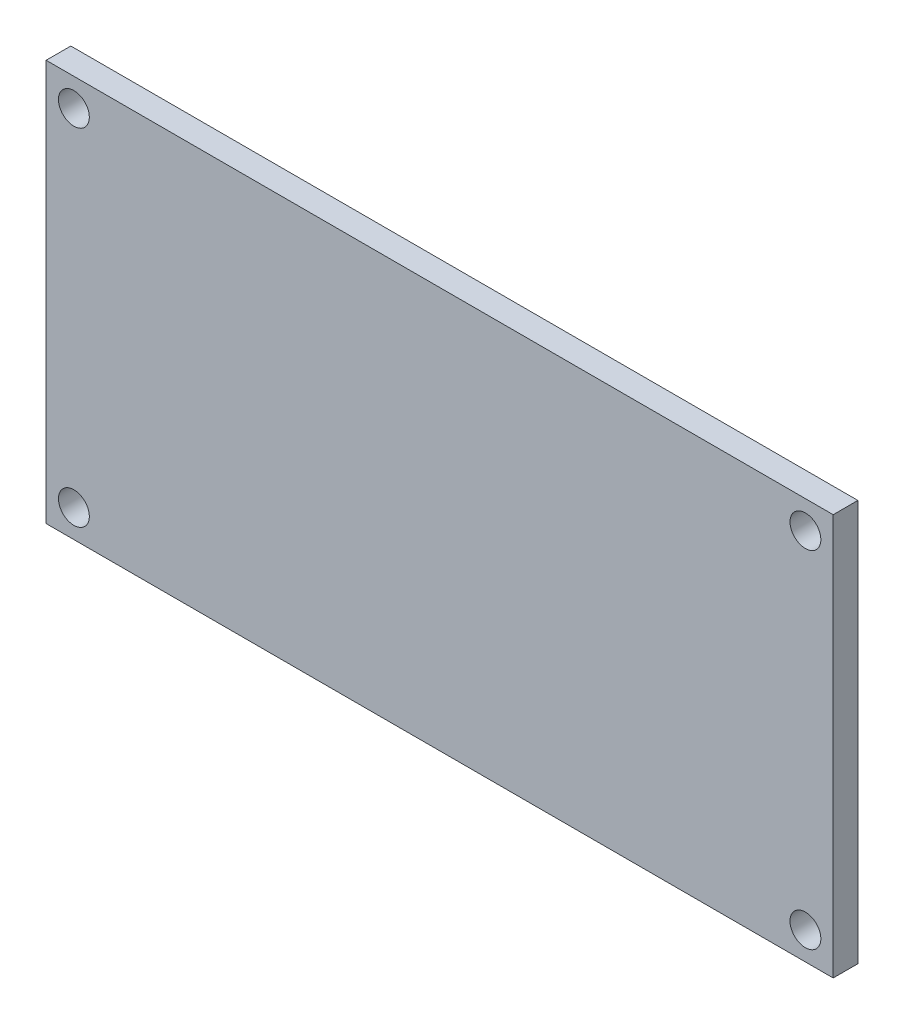
ISO-10303-21;
HEADER;
FILE_DESCRIPTION(('STEP AP214'),'2;1');
FILE_NAME('part.step','',(''),(''),'','','');
FILE_SCHEMA(('AUTOMOTIVE_DESIGN { 1 0 10303 214 1 1 1 1 }'));
ENDSEC;
DATA;
#1=APPLICATION_CONTEXT('core data for automotive mechanical design processes');
#2=APPLICATION_PROTOCOL_DEFINITION('international standard','automotive_design',2000,#1);
#3=PRODUCT_CONTEXT('',#1,'mechanical');
#4=PRODUCT('Part','Part','',(#3));
#5=PRODUCT_RELATED_PRODUCT_CATEGORY('part','',(#4));
#6=PRODUCT_DEFINITION_FORMATION('','',#4);
#7=PRODUCT_DEFINITION_CONTEXT('part definition',#1,'design');
#8=PRODUCT_DEFINITION('design','',#6,#7);
#9=PRODUCT_DEFINITION_SHAPE('','',#8);
#10=(LENGTH_UNIT() NAMED_UNIT(*) SI_UNIT(.MILLI.,.METRE.));
#11=(NAMED_UNIT(*) PLANE_ANGLE_UNIT() SI_UNIT($,.RADIAN.));
#12=(NAMED_UNIT(*) SI_UNIT($,.STERADIAN.) SOLID_ANGLE_UNIT());
#13=UNCERTAINTY_MEASURE_WITH_UNIT(LENGTH_MEASURE(1.E-05),#10,'distance_accuracy_value','');
#14=(GEOMETRIC_REPRESENTATION_CONTEXT(3) GLOBAL_UNCERTAINTY_ASSIGNED_CONTEXT((#13)) GLOBAL_UNIT_ASSIGNED_CONTEXT((#10,
#11,#12)) REPRESENTATION_CONTEXT('',''));
#15=CARTESIAN_POINT('',(0.,0.,0.));
#16=DIRECTION('',(0.,0.,1.));
#17=DIRECTION('',(1.,0.,0.));
#18=AXIS2_PLACEMENT_3D('',#15,#16,#17);
#19=CARTESIAN_POINT('',(0.,0.,1.6));
#20=DIRECTION('',(0.,0.,-1.));
#21=DIRECTION('',(-1.,0.,0.));
#22=AXIS2_PLACEMENT_3D('',#19,#20,#21);
#23=PLANE('',#22);
#24=DIRECTION('',(0.,1.,0.));
#25=VECTOR('',#24,1.);
#26=CARTESIAN_POINT('',(25.5,-13.,1.6));
#27=LINE('',#26,#25);
#28=CARTESIAN_POINT('',(25.5,-13.,1.6));
#29=VERTEX_POINT('',#28);
#30=CARTESIAN_POINT('',(25.5,13.,1.6));
#31=VERTEX_POINT('',#30);
#32=EDGE_CURVE('E92',#29,#31,#27,.T.);
#33=ORIENTED_EDGE('',*,*,#32,.T.);
#34=DIRECTION('',(-1.,0.,0.));
#35=VECTOR('',#34,1.);
#36=CARTESIAN_POINT('',(-25.5,13.,1.6));
#37=LINE('',#36,#35);
#38=CARTESIAN_POINT('',(-25.5,13.,1.6));
#39=VERTEX_POINT('',#38);
#40=EDGE_CURVE('E87',#31,#39,#37,.T.);
#41=ORIENTED_EDGE('',*,*,#40,.T.);
#42=DIRECTION('',(0.,-1.,0.));
#43=VECTOR('',#42,1.);
#44=CARTESIAN_POINT('',(-25.5,-13.,1.6));
#45=LINE('',#44,#43);
#46=CARTESIAN_POINT('',(-25.5,-13.,1.6));
#47=VERTEX_POINT('',#46);
#48=EDGE_CURVE('E90',#39,#47,#45,.T.);
#49=ORIENTED_EDGE('',*,*,#48,.T.);
#50=DIRECTION('',(1.,0.,0.));
#51=VECTOR('',#50,1.);
#52=CARTESIAN_POINT('',(-25.5,-13.,1.6));
#53=LINE('',#52,#51);
#54=EDGE_CURVE('E57',#47,#29,#53,.T.);
#55=ORIENTED_EDGE('',*,*,#54,.T.);
#56=EDGE_LOOP('',(#33,#41,#49,#55));
#57=FACE_BOUND('',#56,.T.);
#58=CARTESIAN_POINT('',(-23.7,11.2,1.6));
#59=DIRECTION('',(0.,0.,1.));
#60=DIRECTION('',(1.,0.,0.));
#61=AXIS2_PLACEMENT_3D('',#58,#59,#60);
#62=CIRCLE('',#61,1.);
#63=CARTESIAN_POINT('',(-22.7,11.2,1.6));
#64=VERTEX_POINT('',#63);
#65=EDGE_CURVE('E112',#64,#64,#62,.T.);
#66=ORIENTED_EDGE('',*,*,#65,.F.);
#67=EDGE_LOOP('',(#66));
#68=FACE_BOUND('',#67,.T.);
#69=CARTESIAN_POINT('',(-23.7,-11.2,1.6));
#70=DIRECTION('',(0.,0.,1.));
#71=DIRECTION('',(-1.,0.,0.));
#72=AXIS2_PLACEMENT_3D('',#69,#70,#71);
#73=CIRCLE('',#72,1.);
#74=CARTESIAN_POINT('',(-24.7,-11.2,1.6));
#75=VERTEX_POINT('',#74);
#76=EDGE_CURVE('E134',#75,#75,#73,.T.);
#77=ORIENTED_EDGE('',*,*,#76,.F.);
#78=EDGE_LOOP('',(#77));
#79=FACE_BOUND('',#78,.T.);
#80=CARTESIAN_POINT('',(23.7,-11.2,1.6));
#81=DIRECTION('',(0.,0.,1.));
#82=DIRECTION('',(1.,0.,0.));
#83=AXIS2_PLACEMENT_3D('',#80,#81,#82);
#84=CIRCLE('',#83,1.);
#85=CARTESIAN_POINT('',(24.7,-11.2,1.6));
#86=VERTEX_POINT('',#85);
#87=EDGE_CURVE('E142',#86,#86,#84,.T.);
#88=ORIENTED_EDGE('',*,*,#87,.F.);
#89=EDGE_LOOP('',(#88));
#90=FACE_BOUND('',#89,.T.);
#91=CARTESIAN_POINT('',(23.7,11.2,1.6));
#92=DIRECTION('',(0.,0.,1.));
#93=DIRECTION('',(-1.,0.,0.));
#94=AXIS2_PLACEMENT_3D('',#91,#92,#93);
#95=CIRCLE('',#94,1.);
#96=CARTESIAN_POINT('',(22.7,11.2,1.6));
#97=VERTEX_POINT('',#96);
#98=EDGE_CURVE('E150',#97,#97,#95,.T.);
#99=ORIENTED_EDGE('',*,*,#98,.F.);
#100=EDGE_LOOP('',(#99));
#101=FACE_BOUND('',#100,.T.);
#102=ADVANCED_FACE('F39',(#57,#68,#79,#90,#101),#23,.F.);
#103=CARTESIAN_POINT('',(0.,0.,0.));
#104=DIRECTION('',(0.,0.,-1.));
#105=DIRECTION('',(-1.,0.,0.));
#106=AXIS2_PLACEMENT_3D('',#103,#104,#105);
#107=PLANE('',#106);
#108=CARTESIAN_POINT('',(23.7,-11.2,0.));
#109=DIRECTION('',(0.,0.,1.));
#110=DIRECTION('',(1.,0.,0.));
#111=AXIS2_PLACEMENT_3D('',#108,#109,#110);
#112=CIRCLE('',#111,1.);
#113=CARTESIAN_POINT('',(24.7,-11.2,0.));
#114=VERTEX_POINT('',#113);
#115=EDGE_CURVE('E146',#114,#114,#112,.T.);
#116=ORIENTED_EDGE('',*,*,#115,.T.);
#117=EDGE_LOOP('',(#116));
#118=FACE_BOUND('',#117,.T.);
#119=CARTESIAN_POINT('',(-23.7,11.2,0.));
#120=DIRECTION('',(0.,0.,1.));
#121=DIRECTION('',(1.,0.,0.));
#122=AXIS2_PLACEMENT_3D('',#119,#120,#121);
#123=CIRCLE('',#122,1.);
#124=CARTESIAN_POINT('',(-22.7,11.2,0.));
#125=VERTEX_POINT('',#124);
#126=EDGE_CURVE('E130',#125,#125,#123,.T.);
#127=ORIENTED_EDGE('',*,*,#126,.T.);
#128=EDGE_LOOP('',(#127));
#129=FACE_BOUND('',#128,.T.);
#130=DIRECTION('',(0.,1.,0.));
#131=VECTOR('',#130,1.);
#132=CARTESIAN_POINT('',(25.5,-13.,0.));
#133=LINE('',#132,#131);
#134=CARTESIAN_POINT('',(25.5,-13.,0.));
#135=VERTEX_POINT('',#134);
#136=CARTESIAN_POINT('',(25.5,13.,0.));
#137=VERTEX_POINT('',#136);
#138=EDGE_CURVE('E108',#135,#137,#133,.T.);
#139=ORIENTED_EDGE('',*,*,#138,.F.);
#140=DIRECTION('',(1.,0.,0.));
#141=VECTOR('',#140,1.);
#142=CARTESIAN_POINT('',(-25.5,-13.,0.));
#143=LINE('',#142,#141);
#144=CARTESIAN_POINT('',(-25.5,-13.,0.));
#145=VERTEX_POINT('',#144);
#146=EDGE_CURVE('E80',#145,#135,#143,.T.);
#147=ORIENTED_EDGE('',*,*,#146,.F.);
#148=DIRECTION('',(0.,-1.,0.));
#149=VECTOR('',#148,1.);
#150=CARTESIAN_POINT('',(-25.5,-13.,0.));
#151=LINE('',#150,#149);
#152=CARTESIAN_POINT('',(-25.5,13.,0.));
#153=VERTEX_POINT('',#152);
#154=EDGE_CURVE('E74',#153,#145,#151,.T.);
#155=ORIENTED_EDGE('',*,*,#154,.F.);
#156=DIRECTION('',(-1.,0.,0.));
#157=VECTOR('',#156,1.);
#158=CARTESIAN_POINT('',(-25.5,13.,0.));
#159=LINE('',#158,#157);
#160=EDGE_CURVE('E97',#137,#153,#159,.T.);
#161=ORIENTED_EDGE('',*,*,#160,.F.);
#162=EDGE_LOOP('',(#139,#147,#155,#161));
#163=FACE_BOUND('',#162,.T.);
#164=CARTESIAN_POINT('',(-23.7,-11.2,0.));
#165=DIRECTION('',(0.,0.,1.));
#166=DIRECTION('',(-1.,0.,0.));
#167=AXIS2_PLACEMENT_3D('',#164,#165,#166);
#168=CIRCLE('',#167,1.);
#169=CARTESIAN_POINT('',(-24.7,-11.2,0.));
#170=VERTEX_POINT('',#169);
#171=EDGE_CURVE('E138',#170,#170,#168,.T.);
#172=ORIENTED_EDGE('',*,*,#171,.T.);
#173=EDGE_LOOP('',(#172));
#174=FACE_BOUND('',#173,.T.);
#175=CARTESIAN_POINT('',(23.7,11.2,0.));
#176=DIRECTION('',(0.,0.,1.));
#177=DIRECTION('',(-1.,0.,0.));
#178=AXIS2_PLACEMENT_3D('',#175,#176,#177);
#179=CIRCLE('',#178,1.);
#180=CARTESIAN_POINT('',(22.7,11.2,0.));
#181=VERTEX_POINT('',#180);
#182=EDGE_CURVE('E154',#181,#181,#179,.T.);
#183=ORIENTED_EDGE('',*,*,#182,.T.);
#184=EDGE_LOOP('',(#183));
#185=FACE_BOUND('',#184,.T.);
#186=ADVANCED_FACE('F125',(#118,#129,#163,#174,#185),#107,.T.);
#187=CARTESIAN_POINT('',(25.5,-13.,1.6));
#188=DIRECTION('',(-1.,0.,0.));
#189=DIRECTION('',(0.,0.,1.));
#190=AXIS2_PLACEMENT_3D('',#187,#188,#189);
#191=PLANE('',#190);
#192=ORIENTED_EDGE('',*,*,#138,.T.);
#193=DIRECTION('',(0.,0.,-1.));
#194=VECTOR('',#193,1.);
#195=CARTESIAN_POINT('',(25.5,13.,1.6));
#196=LINE('',#195,#194);
#197=EDGE_CURVE('E11',#31,#137,#196,.T.);
#198=ORIENTED_EDGE('',*,*,#197,.F.);
#199=ORIENTED_EDGE('',*,*,#32,.F.);
#200=DIRECTION('',(0.,0.,-1.));
#201=VECTOR('',#200,1.);
#202=CARTESIAN_POINT('',(25.5,-13.,1.6));
#203=LINE('',#202,#201);
#204=EDGE_CURVE('E104',#29,#135,#203,.T.);
#205=ORIENTED_EDGE('',*,*,#204,.T.);
#206=EDGE_LOOP('',(#192,#198,#199,#205));
#207=FACE_BOUND('',#206,.T.);
#208=ADVANCED_FACE('F41',(#207),#191,.F.);
#209=CARTESIAN_POINT('',(-25.5,13.,1.6));
#210=DIRECTION('',(0.,-1.,0.));
#211=DIRECTION('',(0.,0.,-1.));
#212=AXIS2_PLACEMENT_3D('',#209,#210,#211);
#213=PLANE('',#212);
#214=ORIENTED_EDGE('',*,*,#160,.T.);
#215=DIRECTION('',(0.,0.,-1.));
#216=VECTOR('',#215,1.);
#217=CARTESIAN_POINT('',(-25.5,13.,1.6));
#218=LINE('',#217,#216);
#219=EDGE_CURVE('E49',#39,#153,#218,.T.);
#220=ORIENTED_EDGE('',*,*,#219,.F.);
#221=ORIENTED_EDGE('',*,*,#40,.F.);
#222=ORIENTED_EDGE('',*,*,#197,.T.);
#223=EDGE_LOOP('',(#214,#220,#221,#222));
#224=FACE_BOUND('',#223,.T.);
#225=ADVANCED_FACE('F96',(#224),#213,.F.);
#226=CARTESIAN_POINT('',(-25.5,-13.,1.6));
#227=DIRECTION('',(1.,0.,0.));
#228=DIRECTION('',(0.,0.,-1.));
#229=AXIS2_PLACEMENT_3D('',#226,#227,#228);
#230=PLANE('',#229);
#231=ORIENTED_EDGE('',*,*,#154,.T.);
#232=DIRECTION('',(0.,0.,-1.));
#233=VECTOR('',#232,1.);
#234=CARTESIAN_POINT('',(-25.5,-13.,1.6));
#235=LINE('',#234,#233);
#236=EDGE_CURVE('E99',#47,#145,#235,.T.);
#237=ORIENTED_EDGE('',*,*,#236,.F.);
#238=ORIENTED_EDGE('',*,*,#48,.F.);
#239=ORIENTED_EDGE('',*,*,#219,.T.);
#240=EDGE_LOOP('',(#231,#237,#238,#239));
#241=FACE_BOUND('',#240,.T.);
#242=ADVANCED_FACE('F100',(#241),#230,.F.);
#243=CARTESIAN_POINT('',(-25.5,-13.,1.6));
#244=DIRECTION('',(0.,1.,0.));
#245=DIRECTION('',(0.,0.,1.));
#246=AXIS2_PLACEMENT_3D('',#243,#244,#245);
#247=PLANE('',#246);
#248=ORIENTED_EDGE('',*,*,#146,.T.);
#249=ORIENTED_EDGE('',*,*,#204,.F.);
#250=ORIENTED_EDGE('',*,*,#54,.F.);
#251=ORIENTED_EDGE('',*,*,#236,.T.);
#252=EDGE_LOOP('',(#248,#249,#250,#251));
#253=FACE_BOUND('',#252,.T.);
#254=ADVANCED_FACE('F122',(#253),#247,.F.);
#255=CARTESIAN_POINT('',(-23.7,11.2,1.6));
#256=DIRECTION('',(0.,0.,-1.));
#257=DIRECTION('',(-1.,0.,0.));
#258=AXIS2_PLACEMENT_3D('',#255,#256,#257);
#259=CYLINDRICAL_SURFACE('',#258,1.);
#260=ORIENTED_EDGE('',*,*,#65,.T.);
#261=EDGE_LOOP('',(#260));
#262=FACE_BOUND('',#261,.T.);
#263=ORIENTED_EDGE('',*,*,#126,.F.);
#264=EDGE_LOOP('',(#263));
#265=FACE_BOUND('',#264,.T.);
#266=ADVANCED_FACE('F173',(#262,#265),#259,.F.);
#267=CARTESIAN_POINT('',(-23.7,-11.2,1.6));
#268=DIRECTION('',(0.,0.,-1.));
#269=DIRECTION('',(-1.,0.,0.));
#270=AXIS2_PLACEMENT_3D('',#267,#268,#269);
#271=CYLINDRICAL_SURFACE('',#270,1.);
#272=ORIENTED_EDGE('',*,*,#76,.T.);
#273=EDGE_LOOP('',(#272));
#274=FACE_BOUND('',#273,.T.);
#275=ORIENTED_EDGE('',*,*,#171,.F.);
#276=EDGE_LOOP('',(#275));
#277=FACE_BOUND('',#276,.T.);
#278=ADVANCED_FACE('F219',(#274,#277),#271,.F.);
#279=CARTESIAN_POINT('',(23.7,-11.2,1.6));
#280=DIRECTION('',(0.,0.,-1.));
#281=DIRECTION('',(-1.,0.,0.));
#282=AXIS2_PLACEMENT_3D('',#279,#280,#281);
#283=CYLINDRICAL_SURFACE('',#282,1.);
#284=ORIENTED_EDGE('',*,*,#87,.T.);
#285=EDGE_LOOP('',(#284));
#286=FACE_BOUND('',#285,.T.);
#287=ORIENTED_EDGE('',*,*,#115,.F.);
#288=EDGE_LOOP('',(#287));
#289=FACE_BOUND('',#288,.T.);
#290=ADVANCED_FACE('F227',(#286,#289),#283,.F.);
#291=CARTESIAN_POINT('',(23.7,11.2,1.6));
#292=DIRECTION('',(0.,0.,-1.));
#293=DIRECTION('',(-1.,0.,0.));
#294=AXIS2_PLACEMENT_3D('',#291,#292,#293);
#295=CYLINDRICAL_SURFACE('',#294,1.);
#296=ORIENTED_EDGE('',*,*,#98,.T.);
#297=EDGE_LOOP('',(#296));
#298=FACE_BOUND('',#297,.T.);
#299=ORIENTED_EDGE('',*,*,#182,.F.);
#300=EDGE_LOOP('',(#299));
#301=FACE_BOUND('',#300,.T.);
#302=ADVANCED_FACE('F162',(#298,#301),#295,.F.);
#303=CLOSED_SHELL('',(#102,#186,#208,#225,#242,#254,#266,#278,#290,#302));
#304=MANIFOLD_SOLID_BREP('B2',#303);
#305=ADVANCED_BREP_SHAPE_REPRESENTATION('',(#18,#304),#14);
#306=SHAPE_DEFINITION_REPRESENTATION(#9,#305);
ENDSEC;
END-ISO-10303-21;
